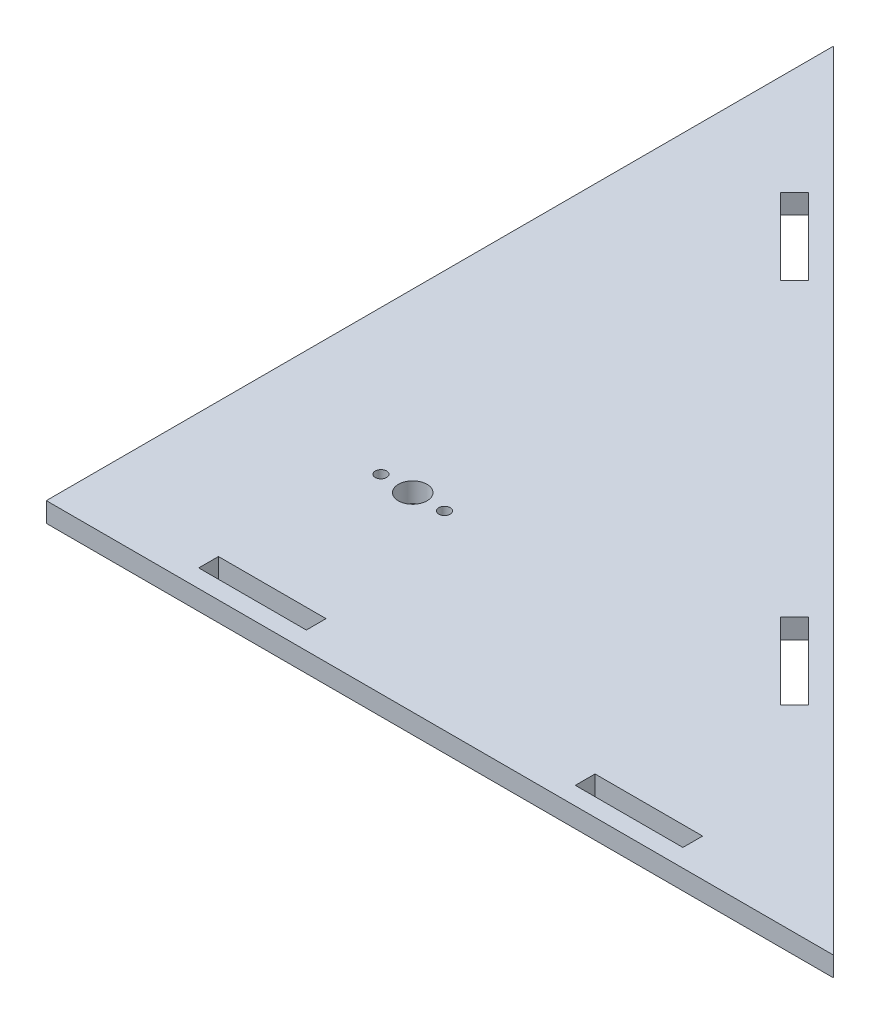
ISO-10303-21;
HEADER;
FILE_DESCRIPTION(('STEP AP214'),'2;1');
FILE_NAME('part.step','',(''),(''),'','','');
FILE_SCHEMA(('AUTOMOTIVE_DESIGN { 1 0 10303 214 1 1 1 1 }'));
ENDSEC;
DATA;
#1=APPLICATION_CONTEXT('core data for automotive mechanical design processes');
#2=APPLICATION_PROTOCOL_DEFINITION('international standard','automotive_design',2000,#1);
#3=PRODUCT_CONTEXT('',#1,'mechanical');
#4=PRODUCT('Part','Part','',(#3));
#5=PRODUCT_RELATED_PRODUCT_CATEGORY('part','',(#4));
#6=PRODUCT_DEFINITION_FORMATION('','',#4);
#7=PRODUCT_DEFINITION_CONTEXT('part definition',#1,'design');
#8=PRODUCT_DEFINITION('design','',#6,#7);
#9=PRODUCT_DEFINITION_SHAPE('','',#8);
#10=(LENGTH_UNIT() NAMED_UNIT(*) SI_UNIT(.MILLI.,.METRE.));
#11=(NAMED_UNIT(*) PLANE_ANGLE_UNIT() SI_UNIT($,.RADIAN.));
#12=(NAMED_UNIT(*) SI_UNIT($,.STERADIAN.) SOLID_ANGLE_UNIT());
#13=UNCERTAINTY_MEASURE_WITH_UNIT(LENGTH_MEASURE(1.E-05),#10,'distance_accuracy_value','');
#14=(GEOMETRIC_REPRESENTATION_CONTEXT(3) GLOBAL_UNCERTAINTY_ASSIGNED_CONTEXT((#13)) GLOBAL_UNIT_ASSIGNED_CONTEXT((#10,
#11,#12)) REPRESENTATION_CONTEXT('',''));
#15=CARTESIAN_POINT('',(0.,0.,0.));
#16=DIRECTION('',(0.,0.,1.));
#17=DIRECTION('',(1.,0.,0.));
#18=AXIS2_PLACEMENT_3D('',#15,#16,#17);
#19=CARTESIAN_POINT('',(0.,2.794,0.));
#20=DIRECTION('',(0.,1.,0.));
#21=DIRECTION('',(0.,0.,1.));
#22=AXIS2_PLACEMENT_3D('',#19,#20,#21);
#23=PLANE('',#22);
#24=CARTESIAN_POINT('',(20.4642320165723,2.794,-26.9373873395286));
#25=DIRECTION('',(0.,1.,0.));
#26=DIRECTION('',(0.,0.,1.));
#27=AXIS2_PLACEMENT_3D('',#24,#25,#26);
#28=CIRCLE('',#27,0.806450000000001);
#29=CARTESIAN_POINT('',(20.4642320165723,2.794,-26.1309373395286));
#30=VERTEX_POINT('',#29);
#31=EDGE_CURVE('E429',#30,#30,#28,.T.);
#32=ORIENTED_EDGE('',*,*,#31,.F.);
#33=EDGE_LOOP('',(#32));
#34=FACE_BOUND('',#33,.T.);
#35=DIRECTION('',(0.707106781186548,0.,0.707106781186547));
#36=VECTOR('',#35,1.);
#37=CARTESIAN_POINT('',(66.2742901734903,2.794,-37.7136946848116));
#38=LINE('',#37,#36);
#39=CARTESIAN_POINT('',(66.2742901734903,2.794,-37.7136946848116));
#40=VERTEX_POINT('',#39);
#41=CARTESIAN_POINT('',(77.0505975187733,2.794,-26.9373873395286));
#42=VERTEX_POINT('',#41);
#43=EDGE_CURVE('E172',#40,#42,#38,.T.);
#44=ORIENTED_EDGE('',*,*,#43,.F.);
#45=DIRECTION('',(-0.707106781186549,0.,0.707106781186546));
#46=VECTOR('',#45,1.);
#47=CARTESIAN_POINT('',(68.2499465201256,2.794,-39.6893510314468));
#48=LINE('',#47,#46);
#49=CARTESIAN_POINT('',(68.2499465201256,2.794,-39.6893510314468));
#50=VERTEX_POINT('',#49);
#51=EDGE_CURVE('E164',#50,#40,#48,.T.);
#52=ORIENTED_EDGE('',*,*,#51,.F.);
#53=DIRECTION('',(-0.707106781186548,0.,-0.707106781186548));
#54=VECTOR('',#53,1.);
#55=CARTESIAN_POINT('',(68.2499465201256,2.794,-39.6893510314468));
#56=LINE('',#55,#54);
#57=CARTESIAN_POINT('',(79.0262538654085,2.794,-28.9130436861638));
#58=VERTEX_POINT('',#57);
#59=EDGE_CURVE('E187',#58,#50,#56,.T.);
#60=ORIENTED_EDGE('',*,*,#59,.F.);
#61=DIRECTION('',(0.707106781186545,0.,-0.70710678118655));
#62=VECTOR('',#61,1.);
#63=CARTESIAN_POINT('',(79.0262538654085,2.794,-28.9130436861638));
#64=LINE('',#63,#62);
#65=EDGE_CURVE('E185',#42,#58,#64,.T.);
#66=ORIENTED_EDGE('',*,*,#65,.F.);
#67=EDGE_LOOP('',(#44,#52,#60,#66));
#68=FACE_BOUND('',#67,.T.);
#69=DIRECTION('',(1.,0.,0.));
#70=VECTOR('',#69,1.);
#71=CARTESIAN_POINT('',(72.39,2.794,-2.54));
#72=LINE('',#71,#70);
#73=CARTESIAN_POINT('',(72.39,2.794,-2.54));
#74=VERTEX_POINT('',#73);
#75=CARTESIAN_POINT('',(87.63,2.794,-2.54));
#76=VERTEX_POINT('',#75);
#77=EDGE_CURVE('E236',#74,#76,#72,.T.);
#78=ORIENTED_EDGE('',*,*,#77,.F.);
#79=DIRECTION('',(0.,0.,1.));
#80=VECTOR('',#79,1.);
#81=CARTESIAN_POINT('',(72.39,2.794,-5.334));
#82=LINE('',#81,#80);
#83=CARTESIAN_POINT('',(72.39,2.794,-5.334));
#84=VERTEX_POINT('',#83);
#85=EDGE_CURVE('E234',#84,#74,#82,.T.);
#86=ORIENTED_EDGE('',*,*,#85,.F.);
#87=DIRECTION('',(-1.,0.,0.));
#88=VECTOR('',#87,1.);
#89=CARTESIAN_POINT('',(72.39,2.794,-5.334));
#90=LINE('',#89,#88);
#91=CARTESIAN_POINT('',(87.63,2.794,-5.334));
#92=VERTEX_POINT('',#91);
#93=EDGE_CURVE('E242',#92,#84,#90,.T.);
#94=ORIENTED_EDGE('',*,*,#93,.F.);
#95=DIRECTION('',(0.,0.,-1.));
#96=VECTOR('',#95,1.);
#97=CARTESIAN_POINT('',(87.63,2.794,-5.334));
#98=LINE('',#97,#96);
#99=EDGE_CURVE('E239',#76,#92,#98,.T.);
#100=ORIENTED_EDGE('',*,*,#99,.F.);
#101=EDGE_LOOP('',(#78,#86,#94,#100));
#102=FACE_BOUND('',#101,.T.);
#103=DIRECTION('',(0.,0.,1.));
#104=VECTOR('',#103,1.);
#105=CARTESIAN_POINT('',(0.,2.794,-111.5314));
#106=LINE('',#105,#104);
#107=CARTESIAN_POINT('',(0.,2.794,-111.5314));
#108=VERTEX_POINT('',#107);
#109=CARTESIAN_POINT('',(0.,2.794,0.));
#110=VERTEX_POINT('',#109);
#111=EDGE_CURVE('E296',#108,#110,#106,.T.);
#112=ORIENTED_EDGE('',*,*,#111,.T.);
#113=DIRECTION('',(1.,0.,0.));
#114=VECTOR('',#113,1.);
#115=CARTESIAN_POINT('',(0.,2.794,0.));
#116=LINE('',#115,#114);
#117=CARTESIAN_POINT('',(111.5314,2.794,0.));
#118=VERTEX_POINT('',#117);
#119=EDGE_CURVE('E299',#110,#118,#116,.T.);
#120=ORIENTED_EDGE('',*,*,#119,.T.);
#121=DIRECTION('',(-0.707106781186547,0.,-0.707106781186547));
#122=VECTOR('',#121,1.);
#123=CARTESIAN_POINT('',(111.5314,2.794,0.));
#124=LINE('',#123,#122);
#125=EDGE_CURVE('E302',#118,#108,#124,.T.);
#126=ORIENTED_EDGE('',*,*,#125,.T.);
#127=EDGE_LOOP('',(#112,#120,#126));
#128=FACE_BOUND('',#127,.T.);
#129=DIRECTION('',(1.,0.,0.));
#130=VECTOR('',#129,1.);
#131=CARTESIAN_POINT('',(19.05,2.794,-2.54));
#132=LINE('',#131,#130);
#133=CARTESIAN_POINT('',(19.05,2.794,-2.54));
#134=VERTEX_POINT('',#133);
#135=CARTESIAN_POINT('',(34.29,2.794,-2.54));
#136=VERTEX_POINT('',#135);
#137=EDGE_CURVE('E267',#134,#136,#132,.T.);
#138=ORIENTED_EDGE('',*,*,#137,.F.);
#139=DIRECTION('',(0.,0.,1.));
#140=VECTOR('',#139,1.);
#141=CARTESIAN_POINT('',(19.05,2.794,-5.334));
#142=LINE('',#141,#140);
#143=CARTESIAN_POINT('',(19.05,2.794,-5.334));
#144=VERTEX_POINT('',#143);
#145=EDGE_CURVE('E265',#144,#134,#142,.T.);
#146=ORIENTED_EDGE('',*,*,#145,.F.);
#147=DIRECTION('',(-1.,0.,0.));
#148=VECTOR('',#147,1.);
#149=CARTESIAN_POINT('',(19.05,2.794,-5.334));
#150=LINE('',#149,#148);
#151=CARTESIAN_POINT('',(34.29,2.794,-5.334));
#152=VERTEX_POINT('',#151);
#153=EDGE_CURVE('E273',#152,#144,#150,.T.);
#154=ORIENTED_EDGE('',*,*,#153,.F.);
#155=DIRECTION('',(0.,0.,-1.));
#156=VECTOR('',#155,1.);
#157=CARTESIAN_POINT('',(34.29,2.794,-5.334));
#158=LINE('',#157,#156);
#159=EDGE_CURVE('E270',#136,#152,#158,.T.);
#160=ORIENTED_EDGE('',*,*,#159,.F.);
#161=EDGE_LOOP('',(#138,#146,#154,#160));
#162=FACE_BOUND('',#161,.T.);
#163=DIRECTION('',(0.707106781186547,0.,0.707106781186548));
#164=VECTOR('',#163,1.);
#165=CARTESIAN_POINT('',(14.1888046712893,2.794,-89.7991801870127));
#166=LINE('',#165,#164);
#167=CARTESIAN_POINT('',(14.1888046712893,2.794,-89.7991801870127));
#168=VERTEX_POINT('',#167);
#169=CARTESIAN_POINT('',(24.9651120165723,2.794,-79.0228728417297));
#170=VERTEX_POINT('',#169);
#171=EDGE_CURVE('E205',#168,#170,#166,.T.);
#172=ORIENTED_EDGE('',*,*,#171,.F.);
#173=DIRECTION('',(-0.707106781186548,0.,0.707106781186548));
#174=VECTOR('',#173,1.);
#175=CARTESIAN_POINT('',(16.1644610179245,2.794,-91.7748365336479));
#176=LINE('',#175,#174);
#177=CARTESIAN_POINT('',(16.1644610179245,2.794,-91.7748365336479));
#178=VERTEX_POINT('',#177);
#179=EDGE_CURVE('E203',#178,#168,#176,.T.);
#180=ORIENTED_EDGE('',*,*,#179,.F.);
#181=DIRECTION('',(-0.707106781186548,0.,-0.707106781186548));
#182=VECTOR('',#181,1.);
#183=CARTESIAN_POINT('',(16.1644610179245,2.794,-91.7748365336479));
#184=LINE('',#183,#182);
#185=CARTESIAN_POINT('',(26.9407683632075,2.794,-80.9985291883649));
#186=VERTEX_POINT('',#185);
#187=EDGE_CURVE('E211',#186,#178,#184,.T.);
#188=ORIENTED_EDGE('',*,*,#187,.F.);
#189=DIRECTION('',(0.707106781186548,0.,-0.707106781186547));
#190=VECTOR('',#189,1.);
#191=CARTESIAN_POINT('',(26.9407683632075,2.794,-80.9985291883649));
#192=LINE('',#191,#190);
#193=EDGE_CURVE('E208',#170,#186,#192,.T.);
#194=ORIENTED_EDGE('',*,*,#193,.F.);
#195=EDGE_LOOP('',(#172,#180,#188,#194));
#196=FACE_BOUND('',#195,.T.);
#197=CARTESIAN_POINT('',(24.9651120165723,2.794,-26.9373873395286));
#198=DIRECTION('',(0.,1.,0.));
#199=DIRECTION('',(0.,0.,1.));
#200=AXIS2_PLACEMENT_3D('',#197,#198,#199);
#201=CIRCLE('',#200,2.032);
#202=CARTESIAN_POINT('',(24.9651120165723,2.794,-24.9053873395286));
#203=VERTEX_POINT('',#202);
#204=EDGE_CURVE('E193',#203,#203,#201,.T.);
#205=ORIENTED_EDGE('',*,*,#204,.F.);
#206=EDGE_LOOP('',(#205));
#207=FACE_BOUND('',#206,.T.);
#208=CARTESIAN_POINT('',(29.4659920165723,2.794,-26.9373873395286));
#209=DIRECTION('',(0.,1.,0.));
#210=DIRECTION('',(0.,0.,1.));
#211=AXIS2_PLACEMENT_3D('',#208,#209,#210);
#212=CIRCLE('',#211,0.806450000000001);
#213=CARTESIAN_POINT('',(29.4659920165723,2.794,-26.1309373395286));
#214=VERTEX_POINT('',#213);
#215=EDGE_CURVE('E420',#214,#214,#212,.T.);
#216=ORIENTED_EDGE('',*,*,#215,.F.);
#217=EDGE_LOOP('',(#216));
#218=FACE_BOUND('',#217,.T.);
#219=ADVANCED_FACE('F33',(#34,#68,#102,#128,#162,#196,#207,#218),#23,.T.);
#220=CARTESIAN_POINT('',(0.,0.,0.));
#221=DIRECTION('',(0.,1.,0.));
#222=DIRECTION('',(0.,0.,1.));
#223=AXIS2_PLACEMENT_3D('',#220,#221,#222);
#224=PLANE('',#223);
#225=CARTESIAN_POINT('',(20.4642320165723,0.,-26.9373873395286));
#226=DIRECTION('',(0.,1.,0.));
#227=DIRECTION('',(0.,0.,1.));
#228=AXIS2_PLACEMENT_3D('',#225,#226,#227);
#229=CIRCLE('',#228,0.806450000000001);
#230=CARTESIAN_POINT('',(20.4642320165723,0.,-26.1309373395286));
#231=VERTEX_POINT('',#230);
#232=EDGE_CURVE('E426',#231,#231,#229,.T.);
#233=ORIENTED_EDGE('',*,*,#232,.T.);
#234=EDGE_LOOP('',(#233));
#235=FACE_BOUND('',#234,.T.);
#236=DIRECTION('',(-0.707106781186549,0.,0.707106781186546));
#237=VECTOR('',#236,1.);
#238=CARTESIAN_POINT('',(68.2499465201256,0.,-39.6893510314468));
#239=LINE('',#238,#237);
#240=CARTESIAN_POINT('',(68.2499465201256,0.,-39.6893510314468));
#241=VERTEX_POINT('',#240);
#242=CARTESIAN_POINT('',(66.2742901734903,0.,-37.7136946848116));
#243=VERTEX_POINT('',#242);
#244=EDGE_CURVE('E56',#241,#243,#239,.T.);
#245=ORIENTED_EDGE('',*,*,#244,.T.);
#246=DIRECTION('',(0.707106781186548,0.,0.707106781186547));
#247=VECTOR('',#246,1.);
#248=CARTESIAN_POINT('',(66.2742901734903,0.,-37.7136946848116));
#249=LINE('',#248,#247);
#250=CARTESIAN_POINT('',(77.0505975187733,0.,-26.9373873395286));
#251=VERTEX_POINT('',#250);
#252=EDGE_CURVE('E179',#243,#251,#249,.T.);
#253=ORIENTED_EDGE('',*,*,#252,.T.);
#254=DIRECTION('',(0.707106781186545,0.,-0.70710678118655));
#255=VECTOR('',#254,1.);
#256=CARTESIAN_POINT('',(79.0262538654085,0.,-28.9130436861638));
#257=LINE('',#256,#255);
#258=CARTESIAN_POINT('',(79.0262538654085,0.,-28.9130436861638));
#259=VERTEX_POINT('',#258);
#260=EDGE_CURVE('E195',#251,#259,#257,.T.);
#261=ORIENTED_EDGE('',*,*,#260,.T.);
#262=DIRECTION('',(-0.707106781186548,0.,-0.707106781186548));
#263=VECTOR('',#262,1.);
#264=CARTESIAN_POINT('',(68.2499465201256,0.,-39.6893510314468));
#265=LINE('',#264,#263);
#266=EDGE_CURVE('E173',#259,#241,#265,.T.);
#267=ORIENTED_EDGE('',*,*,#266,.T.);
#268=EDGE_LOOP('',(#245,#253,#261,#267));
#269=FACE_BOUND('',#268,.T.);
#270=DIRECTION('',(0.,0.,1.));
#271=VECTOR('',#270,1.);
#272=CARTESIAN_POINT('',(72.39,0.,-5.334));
#273=LINE('',#272,#271);
#274=CARTESIAN_POINT('',(72.39,0.,-5.334));
#275=VERTEX_POINT('',#274);
#276=CARTESIAN_POINT('',(72.39,0.,-2.54));
#277=VERTEX_POINT('',#276);
#278=EDGE_CURVE('E233',#275,#277,#273,.T.);
#279=ORIENTED_EDGE('',*,*,#278,.T.);
#280=DIRECTION('',(1.,0.,0.));
#281=VECTOR('',#280,1.);
#282=CARTESIAN_POINT('',(72.39,0.,-2.54));
#283=LINE('',#282,#281);
#284=CARTESIAN_POINT('',(87.63,0.,-2.54));
#285=VERTEX_POINT('',#284);
#286=EDGE_CURVE('E247',#277,#285,#283,.T.);
#287=ORIENTED_EDGE('',*,*,#286,.T.);
#288=DIRECTION('',(0.,0.,-1.));
#289=VECTOR('',#288,1.);
#290=CARTESIAN_POINT('',(87.63,0.,-5.334));
#291=LINE('',#290,#289);
#292=CARTESIAN_POINT('',(87.63,0.,-5.334));
#293=VERTEX_POINT('',#292);
#294=EDGE_CURVE('E250',#285,#293,#291,.T.);
#295=ORIENTED_EDGE('',*,*,#294,.T.);
#296=DIRECTION('',(-1.,0.,0.));
#297=VECTOR('',#296,1.);
#298=CARTESIAN_POINT('',(72.39,0.,-5.334));
#299=LINE('',#298,#297);
#300=EDGE_CURVE('E237',#293,#275,#299,.T.);
#301=ORIENTED_EDGE('',*,*,#300,.T.);
#302=EDGE_LOOP('',(#279,#287,#295,#301));
#303=FACE_BOUND('',#302,.T.);
#304=DIRECTION('',(0.,0.,1.));
#305=VECTOR('',#304,1.);
#306=CARTESIAN_POINT('',(0.,0.,-111.5314));
#307=LINE('',#306,#305);
#308=CARTESIAN_POINT('',(0.,0.,-111.5314));
#309=VERTEX_POINT('',#308);
#310=CARTESIAN_POINT('',(0.,0.,0.));
#311=VERTEX_POINT('',#310);
#312=EDGE_CURVE('E295',#309,#311,#307,.T.);
#313=ORIENTED_EDGE('',*,*,#312,.F.);
#314=DIRECTION('',(-0.707106781186547,0.,-0.707106781186547));
#315=VECTOR('',#314,1.);
#316=CARTESIAN_POINT('',(111.5314,0.,0.));
#317=LINE('',#316,#315);
#318=CARTESIAN_POINT('',(111.5314,0.,0.));
#319=VERTEX_POINT('',#318);
#320=EDGE_CURVE('E300',#319,#309,#317,.T.);
#321=ORIENTED_EDGE('',*,*,#320,.F.);
#322=DIRECTION('',(1.,0.,0.));
#323=VECTOR('',#322,1.);
#324=CARTESIAN_POINT('',(0.,0.,0.));
#325=LINE('',#324,#323);
#326=EDGE_CURVE('E307',#311,#319,#325,.T.);
#327=ORIENTED_EDGE('',*,*,#326,.F.);
#328=EDGE_LOOP('',(#313,#321,#327));
#329=FACE_BOUND('',#328,.T.);
#330=DIRECTION('',(0.,0.,1.));
#331=VECTOR('',#330,1.);
#332=CARTESIAN_POINT('',(19.05,0.,-5.334));
#333=LINE('',#332,#331);
#334=CARTESIAN_POINT('',(19.05,0.,-5.334));
#335=VERTEX_POINT('',#334);
#336=CARTESIAN_POINT('',(19.05,0.,-2.54));
#337=VERTEX_POINT('',#336);
#338=EDGE_CURVE('E264',#335,#337,#333,.T.);
#339=ORIENTED_EDGE('',*,*,#338,.T.);
#340=DIRECTION('',(1.,0.,0.));
#341=VECTOR('',#340,1.);
#342=CARTESIAN_POINT('',(19.05,0.,-2.54));
#343=LINE('',#342,#341);
#344=CARTESIAN_POINT('',(34.29,0.,-2.54));
#345=VERTEX_POINT('',#344);
#346=EDGE_CURVE('E278',#337,#345,#343,.T.);
#347=ORIENTED_EDGE('',*,*,#346,.T.);
#348=DIRECTION('',(0.,0.,-1.));
#349=VECTOR('',#348,1.);
#350=CARTESIAN_POINT('',(34.29,0.,-5.334));
#351=LINE('',#350,#349);
#352=CARTESIAN_POINT('',(34.29,0.,-5.334));
#353=VERTEX_POINT('',#352);
#354=EDGE_CURVE('E281',#345,#353,#351,.T.);
#355=ORIENTED_EDGE('',*,*,#354,.T.);
#356=DIRECTION('',(-1.,0.,0.));
#357=VECTOR('',#356,1.);
#358=CARTESIAN_POINT('',(19.05,0.,-5.334));
#359=LINE('',#358,#357);
#360=EDGE_CURVE('E268',#353,#335,#359,.T.);
#361=ORIENTED_EDGE('',*,*,#360,.T.);
#362=EDGE_LOOP('',(#339,#347,#355,#361));
#363=FACE_BOUND('',#362,.T.);
#364=DIRECTION('',(-0.707106781186548,0.,0.707106781186548));
#365=VECTOR('',#364,1.);
#366=CARTESIAN_POINT('',(16.1644610179245,0.,-91.7748365336479));
#367=LINE('',#366,#365);
#368=CARTESIAN_POINT('',(16.1644610179245,0.,-91.7748365336479));
#369=VERTEX_POINT('',#368);
#370=CARTESIAN_POINT('',(14.1888046712893,0.,-89.7991801870127));
#371=VERTEX_POINT('',#370);
#372=EDGE_CURVE('E180',#369,#371,#367,.T.);
#373=ORIENTED_EDGE('',*,*,#372,.T.);
#374=DIRECTION('',(0.707106781186547,0.,0.707106781186548));
#375=VECTOR('',#374,1.);
#376=CARTESIAN_POINT('',(14.1888046712893,0.,-89.7991801870127));
#377=LINE('',#376,#375);
#378=CARTESIAN_POINT('',(24.9651120165723,0.,-79.0228728417297));
#379=VERTEX_POINT('',#378);
#380=EDGE_CURVE('E216',#371,#379,#377,.T.);
#381=ORIENTED_EDGE('',*,*,#380,.T.);
#382=DIRECTION('',(0.707106781186548,0.,-0.707106781186547));
#383=VECTOR('',#382,1.);
#384=CARTESIAN_POINT('',(26.9407683632075,0.,-80.9985291883649));
#385=LINE('',#384,#383);
#386=CARTESIAN_POINT('',(26.9407683632075,0.,-80.9985291883649));
#387=VERTEX_POINT('',#386);
#388=EDGE_CURVE('E219',#379,#387,#385,.T.);
#389=ORIENTED_EDGE('',*,*,#388,.T.);
#390=DIRECTION('',(-0.707106781186548,0.,-0.707106781186548));
#391=VECTOR('',#390,1.);
#392=CARTESIAN_POINT('',(16.1644610179245,0.,-91.7748365336479));
#393=LINE('',#392,#391);
#394=EDGE_CURVE('E206',#387,#369,#393,.T.);
#395=ORIENTED_EDGE('',*,*,#394,.T.);
#396=EDGE_LOOP('',(#373,#381,#389,#395));
#397=FACE_BOUND('',#396,.T.);
#398=CARTESIAN_POINT('',(24.9651120165723,0.,-26.9373873395286));
#399=DIRECTION('',(0.,1.,0.));
#400=DIRECTION('',(0.,0.,1.));
#401=AXIS2_PLACEMENT_3D('',#398,#399,#400);
#402=CIRCLE('',#401,2.032);
#403=CARTESIAN_POINT('',(24.9651120165723,0.,-24.9053873395286));
#404=VERTEX_POINT('',#403);
#405=EDGE_CURVE('E432',#404,#404,#402,.T.);
#406=ORIENTED_EDGE('',*,*,#405,.T.);
#407=EDGE_LOOP('',(#406));
#408=FACE_BOUND('',#407,.T.);
#409=CARTESIAN_POINT('',(29.4659920165723,0.,-26.9373873395286));
#410=DIRECTION('',(0.,1.,0.));
#411=DIRECTION('',(0.,0.,1.));
#412=AXIS2_PLACEMENT_3D('',#409,#410,#411);
#413=CIRCLE('',#412,0.806450000000001);
#414=CARTESIAN_POINT('',(29.4659920165723,0.,-26.1309373395286));
#415=VERTEX_POINT('',#414);
#416=EDGE_CURVE('E423',#415,#415,#413,.T.);
#417=ORIENTED_EDGE('',*,*,#416,.T.);
#418=EDGE_LOOP('',(#417));
#419=FACE_BOUND('',#418,.T.);
#420=ADVANCED_FACE('F321',(#235,#269,#303,#329,#363,#397,#408,#419),#224,.F.);
#421=CARTESIAN_POINT('',(0.,2.794,-111.5314));
#422=DIRECTION('',(1.,0.,0.));
#423=DIRECTION('',(0.,0.,-1.));
#424=AXIS2_PLACEMENT_3D('',#421,#422,#423);
#425=PLANE('',#424);
#426=ORIENTED_EDGE('',*,*,#312,.T.);
#427=DIRECTION('',(0.,-1.,0.));
#428=VECTOR('',#427,1.);
#429=CARTESIAN_POINT('',(0.,2.794,0.));
#430=LINE('',#429,#428);
#431=EDGE_CURVE('E11',#110,#311,#430,.T.);
#432=ORIENTED_EDGE('',*,*,#431,.F.);
#433=ORIENTED_EDGE('',*,*,#111,.F.);
#434=DIRECTION('',(0.,-1.,0.));
#435=VECTOR('',#434,1.);
#436=CARTESIAN_POINT('',(0.,2.794,-111.5314));
#437=LINE('',#436,#435);
#438=EDGE_CURVE('E304',#108,#309,#437,.T.);
#439=ORIENTED_EDGE('',*,*,#438,.T.);
#440=EDGE_LOOP('',(#426,#432,#433,#439));
#441=FACE_BOUND('',#440,.T.);
#442=ADVANCED_FACE('F35',(#441),#425,.F.);
#443=CARTESIAN_POINT('',(0.,2.794,0.));
#444=DIRECTION('',(0.,0.,-1.));
#445=DIRECTION('',(-1.,0.,0.));
#446=AXIS2_PLACEMENT_3D('',#443,#444,#445);
#447=PLANE('',#446);
#448=ORIENTED_EDGE('',*,*,#326,.T.);
#449=DIRECTION('',(0.,-1.,0.));
#450=VECTOR('',#449,1.);
#451=CARTESIAN_POINT('',(111.5314,2.794,0.));
#452=LINE('',#451,#450);
#453=EDGE_CURVE('E41',#118,#319,#452,.T.);
#454=ORIENTED_EDGE('',*,*,#453,.F.);
#455=ORIENTED_EDGE('',*,*,#119,.F.);
#456=ORIENTED_EDGE('',*,*,#431,.T.);
#457=EDGE_LOOP('',(#448,#454,#455,#456));
#458=FACE_BOUND('',#457,.T.);
#459=ADVANCED_FACE('F328',(#458),#447,.F.);
#460=CARTESIAN_POINT('',(111.5314,2.794,0.));
#461=DIRECTION('',(-0.707106781186548,0.,0.707106781186548));
#462=DIRECTION('',(0.707106781186548,0.,0.707106781186548));
#463=AXIS2_PLACEMENT_3D('',#460,#461,#462);
#464=PLANE('',#463);
#465=ORIENTED_EDGE('',*,*,#320,.T.);
#466=ORIENTED_EDGE('',*,*,#438,.F.);
#467=ORIENTED_EDGE('',*,*,#125,.F.);
#468=ORIENTED_EDGE('',*,*,#453,.T.);
#469=EDGE_LOOP('',(#465,#466,#467,#468));
#470=FACE_BOUND('',#469,.T.);
#471=ADVANCED_FACE('F316',(#470),#464,.F.);
#472=CARTESIAN_POINT('',(19.05,2.794,-5.334));
#473=DIRECTION('',(1.,0.,0.));
#474=DIRECTION('',(0.,0.,-1.));
#475=AXIS2_PLACEMENT_3D('',#472,#473,#474);
#476=PLANE('',#475);
#477=ORIENTED_EDGE('',*,*,#338,.F.);
#478=DIRECTION('',(0.,-1.,0.));
#479=VECTOR('',#478,1.);
#480=CARTESIAN_POINT('',(19.05,2.794,-5.334));
#481=LINE('',#480,#479);
#482=EDGE_CURVE('E275',#144,#335,#481,.T.);
#483=ORIENTED_EDGE('',*,*,#482,.F.);
#484=ORIENTED_EDGE('',*,*,#145,.T.);
#485=DIRECTION('',(0.,-1.,0.));
#486=VECTOR('',#485,1.);
#487=CARTESIAN_POINT('',(19.05,2.794,-2.54));
#488=LINE('',#487,#486);
#489=EDGE_CURVE('E292',#134,#337,#488,.T.);
#490=ORIENTED_EDGE('',*,*,#489,.T.);
#491=EDGE_LOOP('',(#477,#483,#484,#490));
#492=FACE_BOUND('',#491,.T.);
#493=ADVANCED_FACE('F334',(#492),#476,.T.);
#494=CARTESIAN_POINT('',(19.05,2.794,-2.54));
#495=DIRECTION('',(0.,0.,-1.));
#496=DIRECTION('',(-1.,0.,0.));
#497=AXIS2_PLACEMENT_3D('',#494,#495,#496);
#498=PLANE('',#497);
#499=ORIENTED_EDGE('',*,*,#346,.F.);
#500=ORIENTED_EDGE('',*,*,#489,.F.);
#501=ORIENTED_EDGE('',*,*,#137,.T.);
#502=DIRECTION('',(0.,-1.,0.));
#503=VECTOR('',#502,1.);
#504=CARTESIAN_POINT('',(34.29,2.794,-2.54));
#505=LINE('',#504,#503);
#506=EDGE_CURVE('E290',#136,#345,#505,.T.);
#507=ORIENTED_EDGE('',*,*,#506,.T.);
#508=EDGE_LOOP('',(#499,#500,#501,#507));
#509=FACE_BOUND('',#508,.T.);
#510=ADVANCED_FACE('F348',(#509),#498,.T.);
#511=CARTESIAN_POINT('',(34.29,2.794,-5.334));
#512=DIRECTION('',(-1.,0.,0.));
#513=DIRECTION('',(0.,0.,1.));
#514=AXIS2_PLACEMENT_3D('',#511,#512,#513);
#515=PLANE('',#514);
#516=ORIENTED_EDGE('',*,*,#354,.F.);
#517=ORIENTED_EDGE('',*,*,#506,.F.);
#518=ORIENTED_EDGE('',*,*,#159,.T.);
#519=DIRECTION('',(0.,-1.,0.));
#520=VECTOR('',#519,1.);
#521=CARTESIAN_POINT('',(34.29,2.794,-5.334));
#522=LINE('',#521,#520);
#523=EDGE_CURVE('E288',#152,#353,#522,.T.);
#524=ORIENTED_EDGE('',*,*,#523,.T.);
#525=EDGE_LOOP('',(#516,#517,#518,#524));
#526=FACE_BOUND('',#525,.T.);
#527=ADVANCED_FACE('F352',(#526),#515,.T.);
#528=CARTESIAN_POINT('',(19.05,2.794,-5.334));
#529=DIRECTION('',(0.,0.,1.));
#530=DIRECTION('',(1.,0.,0.));
#531=AXIS2_PLACEMENT_3D('',#528,#529,#530);
#532=PLANE('',#531);
#533=ORIENTED_EDGE('',*,*,#360,.F.);
#534=ORIENTED_EDGE('',*,*,#523,.F.);
#535=ORIENTED_EDGE('',*,*,#153,.T.);
#536=ORIENTED_EDGE('',*,*,#482,.T.);
#537=EDGE_LOOP('',(#533,#534,#535,#536));
#538=FACE_BOUND('',#537,.T.);
#539=ADVANCED_FACE('F356',(#538),#532,.T.);
#540=CARTESIAN_POINT('',(72.39,2.794,-5.334));
#541=DIRECTION('',(1.,0.,0.));
#542=DIRECTION('',(0.,0.,-1.));
#543=AXIS2_PLACEMENT_3D('',#540,#541,#542);
#544=PLANE('',#543);
#545=ORIENTED_EDGE('',*,*,#278,.F.);
#546=DIRECTION('',(0.,-1.,0.));
#547=VECTOR('',#546,1.);
#548=CARTESIAN_POINT('',(72.39,2.794,-5.334));
#549=LINE('',#548,#547);
#550=EDGE_CURVE('E244',#84,#275,#549,.T.);
#551=ORIENTED_EDGE('',*,*,#550,.F.);
#552=ORIENTED_EDGE('',*,*,#85,.T.);
#553=DIRECTION('',(0.,-1.,0.));
#554=VECTOR('',#553,1.);
#555=CARTESIAN_POINT('',(72.39,2.794,-2.54));
#556=LINE('',#555,#554);
#557=EDGE_CURVE('E261',#74,#277,#556,.T.);
#558=ORIENTED_EDGE('',*,*,#557,.T.);
#559=EDGE_LOOP('',(#545,#551,#552,#558));
#560=FACE_BOUND('',#559,.T.);
#561=ADVANCED_FACE('F360',(#560),#544,.T.);
#562=CARTESIAN_POINT('',(72.39,2.794,-2.54));
#563=DIRECTION('',(0.,0.,-1.));
#564=DIRECTION('',(-1.,0.,0.));
#565=AXIS2_PLACEMENT_3D('',#562,#563,#564);
#566=PLANE('',#565);
#567=ORIENTED_EDGE('',*,*,#286,.F.);
#568=ORIENTED_EDGE('',*,*,#557,.F.);
#569=ORIENTED_EDGE('',*,*,#77,.T.);
#570=DIRECTION('',(0.,-1.,0.));
#571=VECTOR('',#570,1.);
#572=CARTESIAN_POINT('',(87.63,2.794,-2.54));
#573=LINE('',#572,#571);
#574=EDGE_CURVE('E259',#76,#285,#573,.T.);
#575=ORIENTED_EDGE('',*,*,#574,.T.);
#576=EDGE_LOOP('',(#567,#568,#569,#575));
#577=FACE_BOUND('',#576,.T.);
#578=ADVANCED_FACE('F364',(#577),#566,.T.);
#579=CARTESIAN_POINT('',(87.63,2.794,-5.334));
#580=DIRECTION('',(-1.,0.,0.));
#581=DIRECTION('',(0.,0.,1.));
#582=AXIS2_PLACEMENT_3D('',#579,#580,#581);
#583=PLANE('',#582);
#584=ORIENTED_EDGE('',*,*,#294,.F.);
#585=ORIENTED_EDGE('',*,*,#574,.F.);
#586=ORIENTED_EDGE('',*,*,#99,.T.);
#587=DIRECTION('',(0.,-1.,0.));
#588=VECTOR('',#587,1.);
#589=CARTESIAN_POINT('',(87.63,2.794,-5.334));
#590=LINE('',#589,#588);
#591=EDGE_CURVE('E257',#92,#293,#590,.T.);
#592=ORIENTED_EDGE('',*,*,#591,.T.);
#593=EDGE_LOOP('',(#584,#585,#586,#592));
#594=FACE_BOUND('',#593,.T.);
#595=ADVANCED_FACE('F368',(#594),#583,.T.);
#596=CARTESIAN_POINT('',(72.39,2.794,-5.334));
#597=DIRECTION('',(0.,0.,1.));
#598=DIRECTION('',(1.,0.,0.));
#599=AXIS2_PLACEMENT_3D('',#596,#597,#598);
#600=PLANE('',#599);
#601=ORIENTED_EDGE('',*,*,#300,.F.);
#602=ORIENTED_EDGE('',*,*,#591,.F.);
#603=ORIENTED_EDGE('',*,*,#93,.T.);
#604=ORIENTED_EDGE('',*,*,#550,.T.);
#605=EDGE_LOOP('',(#601,#602,#603,#604));
#606=FACE_BOUND('',#605,.T.);
#607=ADVANCED_FACE('F372',(#606),#600,.T.);
#608=CARTESIAN_POINT('',(16.1644610179245,2.794,-91.7748365336479));
#609=DIRECTION('',(0.707106781186548,0.,0.707106781186548));
#610=DIRECTION('',(0.707106781186548,0.,-0.707106781186548));
#611=AXIS2_PLACEMENT_3D('',#608,#609,#610);
#612=PLANE('',#611);
#613=ORIENTED_EDGE('',*,*,#372,.F.);
#614=DIRECTION('',(0.,-1.,0.));
#615=VECTOR('',#614,1.);
#616=CARTESIAN_POINT('',(16.1644610179245,2.794,-91.7748365336479));
#617=LINE('',#616,#615);
#618=EDGE_CURVE('E213',#178,#369,#617,.T.);
#619=ORIENTED_EDGE('',*,*,#618,.F.);
#620=ORIENTED_EDGE('',*,*,#179,.T.);
#621=DIRECTION('',(0.,-1.,0.));
#622=VECTOR('',#621,1.);
#623=CARTESIAN_POINT('',(14.1888046712893,2.794,-89.7991801870127));
#624=LINE('',#623,#622);
#625=EDGE_CURVE('E230',#168,#371,#624,.T.);
#626=ORIENTED_EDGE('',*,*,#625,.T.);
#627=EDGE_LOOP('',(#613,#619,#620,#626));
#628=FACE_BOUND('',#627,.T.);
#629=ADVANCED_FACE('F376',(#628),#612,.T.);
#630=CARTESIAN_POINT('',(14.1888046712893,2.794,-89.7991801870127));
#631=DIRECTION('',(0.707106781186548,0.,-0.707106781186548));
#632=DIRECTION('',(-0.707106781186547,0.,-0.707106781186548));
#633=AXIS2_PLACEMENT_3D('',#630,#631,#632);
#634=PLANE('',#633);
#635=ORIENTED_EDGE('',*,*,#380,.F.);
#636=ORIENTED_EDGE('',*,*,#625,.F.);
#637=ORIENTED_EDGE('',*,*,#171,.T.);
#638=DIRECTION('',(0.,-1.,0.));
#639=VECTOR('',#638,1.);
#640=CARTESIAN_POINT('',(24.9651120165723,2.794,-79.0228728417297));
#641=LINE('',#640,#639);
#642=EDGE_CURVE('E228',#170,#379,#641,.T.);
#643=ORIENTED_EDGE('',*,*,#642,.T.);
#644=EDGE_LOOP('',(#635,#636,#637,#643));
#645=FACE_BOUND('',#644,.T.);
#646=ADVANCED_FACE('F380',(#645),#634,.T.);
#647=CARTESIAN_POINT('',(26.9407683632075,2.794,-80.9985291883649));
#648=DIRECTION('',(-0.707106781186547,0.,-0.707106781186548));
#649=DIRECTION('',(-0.707106781186548,0.,0.707106781186547));
#650=AXIS2_PLACEMENT_3D('',#647,#648,#649);
#651=PLANE('',#650);
#652=ORIENTED_EDGE('',*,*,#388,.F.);
#653=ORIENTED_EDGE('',*,*,#642,.F.);
#654=ORIENTED_EDGE('',*,*,#193,.T.);
#655=DIRECTION('',(0.,-1.,0.));
#656=VECTOR('',#655,1.);
#657=CARTESIAN_POINT('',(26.9407683632075,2.794,-80.9985291883649));
#658=LINE('',#657,#656);
#659=EDGE_CURVE('E226',#186,#387,#658,.T.);
#660=ORIENTED_EDGE('',*,*,#659,.T.);
#661=EDGE_LOOP('',(#652,#653,#654,#660));
#662=FACE_BOUND('',#661,.T.);
#663=ADVANCED_FACE('F384',(#662),#651,.T.);
#664=CARTESIAN_POINT('',(16.1644610179245,2.794,-91.7748365336479));
#665=DIRECTION('',(-0.707106781186548,0.,0.707106781186548));
#666=DIRECTION('',(0.707106781186548,0.,0.707106781186548));
#667=AXIS2_PLACEMENT_3D('',#664,#665,#666);
#668=PLANE('',#667);
#669=ORIENTED_EDGE('',*,*,#394,.F.);
#670=ORIENTED_EDGE('',*,*,#659,.F.);
#671=ORIENTED_EDGE('',*,*,#187,.T.);
#672=ORIENTED_EDGE('',*,*,#618,.T.);
#673=EDGE_LOOP('',(#669,#670,#671,#672));
#674=FACE_BOUND('',#673,.T.);
#675=ADVANCED_FACE('F388',(#674),#668,.T.);
#676=CARTESIAN_POINT('',(68.2499465201256,2.794,-39.6893510314468));
#677=DIRECTION('',(0.707106781186546,0.,0.707106781186549));
#678=DIRECTION('',(0.707106781186549,0.,-0.707106781186546));
#679=AXIS2_PLACEMENT_3D('',#676,#677,#678);
#680=PLANE('',#679);
#681=ORIENTED_EDGE('',*,*,#244,.F.);
#682=DIRECTION('',(0.,-1.,0.));
#683=VECTOR('',#682,1.);
#684=CARTESIAN_POINT('',(68.2499465201256,2.794,-39.6893510314468));
#685=LINE('',#684,#683);
#686=EDGE_CURVE('E168',#50,#241,#685,.T.);
#687=ORIENTED_EDGE('',*,*,#686,.F.);
#688=ORIENTED_EDGE('',*,*,#51,.T.);
#689=DIRECTION('',(0.,-1.,0.));
#690=VECTOR('',#689,1.);
#691=CARTESIAN_POINT('',(66.2742901734903,2.794,-37.7136946848116));
#692=LINE('',#691,#690);
#693=EDGE_CURVE('E167',#40,#243,#692,.T.);
#694=ORIENTED_EDGE('',*,*,#693,.T.);
#695=EDGE_LOOP('',(#681,#687,#688,#694));
#696=FACE_BOUND('',#695,.T.);
#697=ADVANCED_FACE('F166',(#696),#680,.T.);
#698=CARTESIAN_POINT('',(66.2742901734903,2.794,-37.7136946848116));
#699=DIRECTION('',(0.707106781186547,0.,-0.707106781186548));
#700=DIRECTION('',(-0.707106781186548,0.,-0.707106781186547));
#701=AXIS2_PLACEMENT_3D('',#698,#699,#700);
#702=PLANE('',#701);
#703=ORIENTED_EDGE('',*,*,#252,.F.);
#704=ORIENTED_EDGE('',*,*,#693,.F.);
#705=ORIENTED_EDGE('',*,*,#43,.T.);
#706=DIRECTION('',(0.,-1.,0.));
#707=VECTOR('',#706,1.);
#708=CARTESIAN_POINT('',(77.0505975187733,2.794,-26.9373873395286));
#709=LINE('',#708,#707);
#710=EDGE_CURVE('E181',#42,#251,#709,.T.);
#711=ORIENTED_EDGE('',*,*,#710,.T.);
#712=EDGE_LOOP('',(#703,#704,#705,#711));
#713=FACE_BOUND('',#712,.T.);
#714=ADVANCED_FACE('F176',(#713),#702,.T.);
#715=CARTESIAN_POINT('',(79.0262538654085,2.794,-28.9130436861638));
#716=DIRECTION('',(-0.70710678118655,0.,-0.707106781186545));
#717=DIRECTION('',(-0.707106781186545,0.,0.70710678118655));
#718=AXIS2_PLACEMENT_3D('',#715,#716,#717);
#719=PLANE('',#718);
#720=ORIENTED_EDGE('',*,*,#260,.F.);
#721=ORIENTED_EDGE('',*,*,#710,.F.);
#722=ORIENTED_EDGE('',*,*,#65,.T.);
#723=DIRECTION('',(0.,-1.,0.));
#724=VECTOR('',#723,1.);
#725=CARTESIAN_POINT('',(79.0262538654085,2.794,-28.9130436861638));
#726=LINE('',#725,#724);
#727=EDGE_CURVE('E48',#58,#259,#726,.T.);
#728=ORIENTED_EDGE('',*,*,#727,.T.);
#729=EDGE_LOOP('',(#720,#721,#722,#728));
#730=FACE_BOUND('',#729,.T.);
#731=ADVANCED_FACE('F397',(#730),#719,.T.);
#732=CARTESIAN_POINT('',(68.2499465201256,2.794,-39.6893510314468));
#733=DIRECTION('',(-0.707106781186548,0.,0.707106781186548));
#734=DIRECTION('',(0.707106781186548,0.,0.707106781186548));
#735=AXIS2_PLACEMENT_3D('',#732,#733,#734);
#736=PLANE('',#735);
#737=ORIENTED_EDGE('',*,*,#266,.F.);
#738=ORIENTED_EDGE('',*,*,#727,.F.);
#739=ORIENTED_EDGE('',*,*,#59,.T.);
#740=ORIENTED_EDGE('',*,*,#686,.T.);
#741=EDGE_LOOP('',(#737,#738,#739,#740));
#742=FACE_BOUND('',#741,.T.);
#743=ADVANCED_FACE('F400',(#742),#736,.T.);
#744=CARTESIAN_POINT('',(24.9651120165723,2.794,-26.9373873395286));
#745=DIRECTION('',(0.,-1.,0.));
#746=DIRECTION('',(0.,0.,-1.));
#747=AXIS2_PLACEMENT_3D('',#744,#745,#746);
#748=CYLINDRICAL_SURFACE('',#747,2.032);
#749=ORIENTED_EDGE('',*,*,#204,.T.);
#750=EDGE_LOOP('',(#749));
#751=FACE_BOUND('',#750,.T.);
#752=ORIENTED_EDGE('',*,*,#405,.F.);
#753=EDGE_LOOP('',(#752));
#754=FACE_BOUND('',#753,.T.);
#755=ADVANCED_FACE('F404',(#751,#754),#748,.F.);
#756=CARTESIAN_POINT('',(20.4642320165723,2.794,-26.9373873395286));
#757=DIRECTION('',(0.,-1.,0.));
#758=DIRECTION('',(0.,0.,-1.));
#759=AXIS2_PLACEMENT_3D('',#756,#757,#758);
#760=CYLINDRICAL_SURFACE('',#759,0.806450000000001);
#761=ORIENTED_EDGE('',*,*,#31,.T.);
#762=EDGE_LOOP('',(#761));
#763=FACE_BOUND('',#762,.T.);
#764=ORIENTED_EDGE('',*,*,#232,.F.);
#765=EDGE_LOOP('',(#764));
#766=FACE_BOUND('',#765,.T.);
#767=ADVANCED_FACE('F407',(#763,#766),#760,.F.);
#768=CARTESIAN_POINT('',(29.4659920165723,2.794,-26.9373873395286));
#769=DIRECTION('',(0.,-1.,0.));
#770=DIRECTION('',(0.,0.,-1.));
#771=AXIS2_PLACEMENT_3D('',#768,#769,#770);
#772=CYLINDRICAL_SURFACE('',#771,0.806450000000001);
#773=ORIENTED_EDGE('',*,*,#215,.T.);
#774=EDGE_LOOP('',(#773));
#775=FACE_BOUND('',#774,.T.);
#776=ORIENTED_EDGE('',*,*,#416,.F.);
#777=EDGE_LOOP('',(#776));
#778=FACE_BOUND('',#777,.T.);
#779=ADVANCED_FACE('F411',(#775,#778),#772,.F.);
#780=CLOSED_SHELL('',(#219,#420,#442,#459,#471,#493,#510,#527,#539,#561,#578,#595,#607,#629,
#646,#663,#675,#697,#714,#731,#743,#755,#767,#779));
#781=MANIFOLD_SOLID_BREP('B2',#780);
#782=ADVANCED_BREP_SHAPE_REPRESENTATION('',(#18,#781),#14);
#783=SHAPE_DEFINITION_REPRESENTATION(#9,#782);
ENDSEC;
END-ISO-10303-21;
